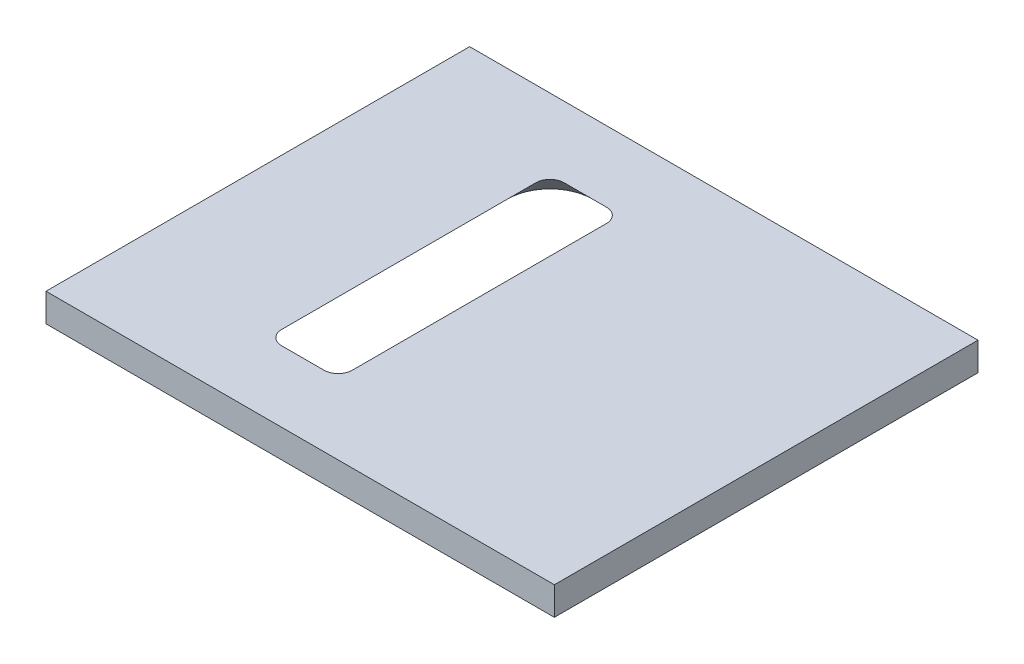
ISO-10303-21;
HEADER;
FILE_DESCRIPTION(('STEP AP214'),'2;1');
FILE_NAME('part.step','',(''),(''),'','','');
FILE_SCHEMA(('AUTOMOTIVE_DESIGN { 1 0 10303 214 1 1 1 1 }'));
ENDSEC;
DATA;
#1=APPLICATION_CONTEXT('core data for automotive mechanical design processes');
#2=APPLICATION_PROTOCOL_DEFINITION('international standard','automotive_design',2000,#1);
#3=PRODUCT_CONTEXT('',#1,'mechanical');
#4=PRODUCT('Part','Part','',(#3));
#5=PRODUCT_RELATED_PRODUCT_CATEGORY('part','',(#4));
#6=PRODUCT_DEFINITION_FORMATION('','',#4);
#7=PRODUCT_DEFINITION_CONTEXT('part definition',#1,'design');
#8=PRODUCT_DEFINITION('design','',#6,#7);
#9=PRODUCT_DEFINITION_SHAPE('','',#8);
#10=(LENGTH_UNIT() NAMED_UNIT(*) SI_UNIT(.MILLI.,.METRE.));
#11=(NAMED_UNIT(*) PLANE_ANGLE_UNIT() SI_UNIT($,.RADIAN.));
#12=(NAMED_UNIT(*) SI_UNIT($,.STERADIAN.) SOLID_ANGLE_UNIT());
#13=UNCERTAINTY_MEASURE_WITH_UNIT(LENGTH_MEASURE(1.E-05),#10,'distance_accuracy_value','');
#14=(GEOMETRIC_REPRESENTATION_CONTEXT(3) GLOBAL_UNCERTAINTY_ASSIGNED_CONTEXT((#13)) GLOBAL_UNIT_ASSIGNED_CONTEXT((#10,
#11,#12)) REPRESENTATION_CONTEXT('',''));
#15=CARTESIAN_POINT('',(0.,0.,0.));
#16=DIRECTION('',(0.,0.,1.));
#17=DIRECTION('',(1.,0.,0.));
#18=AXIS2_PLACEMENT_3D('',#15,#16,#17);
#19=CARTESIAN_POINT('',(22.811028753507,2.,-15.));
#20=DIRECTION('',(-1.,0.,0.));
#21=DIRECTION('',(0.,0.,1.));
#22=AXIS2_PLACEMENT_3D('',#19,#20,#21);
#23=PLANE('',#22);
#24=DIRECTION('',(0.,0.,-1.));
#25=VECTOR('',#24,1.);
#26=CARTESIAN_POINT('',(22.811028753507,0.,-15.));
#27=LINE('',#26,#25);
#28=CARTESIAN_POINT('',(22.811028753507,0.,15.));
#29=VERTEX_POINT('',#28);
#30=CARTESIAN_POINT('',(22.811028753507,0.,-15.));
#31=VERTEX_POINT('',#30);
#32=EDGE_CURVE('E184',#29,#31,#27,.T.);
#33=ORIENTED_EDGE('',*,*,#32,.T.);
#34=DIRECTION('',(0.,-1.,0.));
#35=VECTOR('',#34,1.);
#36=CARTESIAN_POINT('',(22.811028753507,2.,-15.));
#37=LINE('',#36,#35);
#38=CARTESIAN_POINT('',(22.811028753507,2.,-15.));
#39=VERTEX_POINT('',#38);
#40=EDGE_CURVE('E11',#39,#31,#37,.T.);
#41=ORIENTED_EDGE('',*,*,#40,.F.);
#42=DIRECTION('',(0.,0.,-1.));
#43=VECTOR('',#42,1.);
#44=CARTESIAN_POINT('',(22.811028753507,2.,-15.));
#45=LINE('',#44,#43);
#46=CARTESIAN_POINT('',(22.811028753507,2.,15.));
#47=VERTEX_POINT('',#46);
#48=EDGE_CURVE('E195',#47,#39,#45,.T.);
#49=ORIENTED_EDGE('',*,*,#48,.F.);
#50=DIRECTION('',(0.,-1.,0.));
#51=VECTOR('',#50,1.);
#52=CARTESIAN_POINT('',(22.811028753507,2.,15.));
#53=LINE('',#52,#51);
#54=EDGE_CURVE('E205',#47,#29,#53,.T.);
#55=ORIENTED_EDGE('',*,*,#54,.T.);
#56=EDGE_LOOP('',(#33,#41,#49,#55));
#57=FACE_BOUND('',#56,.T.);
#58=ADVANCED_FACE('F37',(#57),#23,.F.);
#59=CARTESIAN_POINT('',(-13.188971246493,2.,-15.));
#60=DIRECTION('',(0.,0.,1.));
#61=DIRECTION('',(1.,0.,0.));
#62=AXIS2_PLACEMENT_3D('',#59,#60,#61);
#63=PLANE('',#62);
#64=DIRECTION('',(-1.,0.,0.));
#65=VECTOR('',#64,1.);
#66=CARTESIAN_POINT('',(-13.188971246493,0.,-15.));
#67=LINE('',#66,#65);
#68=CARTESIAN_POINT('',(-13.188971246493,0.,-15.));
#69=VERTEX_POINT('',#68);
#70=EDGE_CURVE('E208',#31,#69,#67,.T.);
#71=ORIENTED_EDGE('',*,*,#70,.T.);
#72=DIRECTION('',(0.,-1.,0.));
#73=VECTOR('',#72,1.);
#74=CARTESIAN_POINT('',(-13.188971246493,2.,-15.));
#75=LINE('',#74,#73);
#76=CARTESIAN_POINT('',(-13.188971246493,2.,-15.));
#77=VERTEX_POINT('',#76);
#78=EDGE_CURVE('E44',#77,#69,#75,.T.);
#79=ORIENTED_EDGE('',*,*,#78,.F.);
#80=DIRECTION('',(-1.,0.,0.));
#81=VECTOR('',#80,1.);
#82=CARTESIAN_POINT('',(-13.188971246493,2.,-15.));
#83=LINE('',#82,#81);
#84=EDGE_CURVE('E198',#39,#77,#83,.T.);
#85=ORIENTED_EDGE('',*,*,#84,.F.);
#86=ORIENTED_EDGE('',*,*,#40,.T.);
#87=EDGE_LOOP('',(#71,#79,#85,#86));
#88=FACE_BOUND('',#87,.T.);
#89=ADVANCED_FACE('F236',(#88),#63,.F.);
#90=CARTESIAN_POINT('',(-13.188971246493,2.,-15.));
#91=DIRECTION('',(1.,0.,0.));
#92=DIRECTION('',(0.,0.,-1.));
#93=AXIS2_PLACEMENT_3D('',#90,#91,#92);
#94=PLANE('',#93);
#95=DIRECTION('',(0.,0.,1.));
#96=VECTOR('',#95,1.);
#97=CARTESIAN_POINT('',(-13.188971246493,0.,-15.));
#98=LINE('',#97,#96);
#99=CARTESIAN_POINT('',(-13.188971246493,0.,15.));
#100=VERTEX_POINT('',#99);
#101=EDGE_CURVE('E210',#69,#100,#98,.T.);
#102=ORIENTED_EDGE('',*,*,#101,.T.);
#103=DIRECTION('',(0.,-1.,0.));
#104=VECTOR('',#103,1.);
#105=CARTESIAN_POINT('',(-13.188971246493,2.,15.));
#106=LINE('',#105,#104);
#107=CARTESIAN_POINT('',(-13.188971246493,2.,15.));
#108=VERTEX_POINT('',#107);
#109=EDGE_CURVE('E215',#108,#100,#106,.T.);
#110=ORIENTED_EDGE('',*,*,#109,.F.);
#111=DIRECTION('',(0.,0.,1.));
#112=VECTOR('',#111,1.);
#113=CARTESIAN_POINT('',(-13.188971246493,2.,-15.));
#114=LINE('',#113,#112);
#115=EDGE_CURVE('E201',#77,#108,#114,.T.);
#116=ORIENTED_EDGE('',*,*,#115,.F.);
#117=ORIENTED_EDGE('',*,*,#78,.T.);
#118=EDGE_LOOP('',(#102,#110,#116,#117));
#119=FACE_BOUND('',#118,.T.);
#120=ADVANCED_FACE('F222',(#119),#94,.F.);
#121=CARTESIAN_POINT('',(-13.188971246493,2.,15.));
#122=DIRECTION('',(0.,0.,-1.));
#123=DIRECTION('',(-1.,0.,0.));
#124=AXIS2_PLACEMENT_3D('',#121,#122,#123);
#125=PLANE('',#124);
#126=DIRECTION('',(1.,0.,0.));
#127=VECTOR('',#126,1.);
#128=CARTESIAN_POINT('',(-13.188971246493,0.,15.));
#129=LINE('',#128,#127);
#130=EDGE_CURVE('E199',#100,#29,#129,.T.);
#131=ORIENTED_EDGE('',*,*,#130,.T.);
#132=ORIENTED_EDGE('',*,*,#54,.F.);
#133=DIRECTION('',(1.,0.,0.));
#134=VECTOR('',#133,1.);
#135=CARTESIAN_POINT('',(-13.188971246493,2.,15.));
#136=LINE('',#135,#134);
#137=EDGE_CURVE('E203',#108,#47,#136,.T.);
#138=ORIENTED_EDGE('',*,*,#137,.F.);
#139=ORIENTED_EDGE('',*,*,#109,.T.);
#140=EDGE_LOOP('',(#131,#132,#138,#139));
#141=FACE_BOUND('',#140,.T.);
#142=ADVANCED_FACE('F231',(#141),#125,.F.);
#143=CARTESIAN_POINT('',(0.,2.,0.));
#144=DIRECTION('',(0.,1.,0.));
#145=DIRECTION('',(0.,0.,1.));
#146=AXIS2_PLACEMENT_3D('',#143,#144,#145);
#147=PLANE('',#146);
#148=CARTESIAN_POINT('',(1.5,2.,9.));
#149=DIRECTION('',(0.,1.,0.));
#150=DIRECTION('',(0.,0.,1.));
#151=AXIS2_PLACEMENT_3D('',#148,#149,#150);
#152=CIRCLE('',#151,1.);
#153=CARTESIAN_POINT('',(1.5,2.,10.));
#154=VERTEX_POINT('',#153);
#155=CARTESIAN_POINT('',(2.5,2.,9.));
#156=VERTEX_POINT('',#155);
#157=EDGE_CURVE('E51',#154,#156,#152,.T.);
#158=ORIENTED_EDGE('',*,*,#157,.F.);
#159=DIRECTION('',(1.,0.,0.));
#160=VECTOR('',#159,1.);
#161=CARTESIAN_POINT('',(1.5,2.,10.));
#162=LINE('',#161,#160);
#163=CARTESIAN_POINT('',(-1.5,2.,10.));
#164=VERTEX_POINT('',#163);
#165=EDGE_CURVE('E158',#164,#154,#162,.T.);
#166=ORIENTED_EDGE('',*,*,#165,.F.);
#167=CARTESIAN_POINT('',(-1.5,2.,9.));
#168=DIRECTION('',(0.,1.,0.));
#169=DIRECTION('',(0.,0.,-1.));
#170=AXIS2_PLACEMENT_3D('',#167,#168,#169);
#171=CIRCLE('',#170,1.);
#172=CARTESIAN_POINT('',(-2.5,2.,9.));
#173=VERTEX_POINT('',#172);
#174=EDGE_CURVE('E155',#173,#164,#171,.T.);
#175=ORIENTED_EDGE('',*,*,#174,.F.);
#176=DIRECTION('',(0.,0.,1.));
#177=VECTOR('',#176,1.);
#178=CARTESIAN_POINT('',(-2.5,2.,9.));
#179=LINE('',#178,#177);
#180=CARTESIAN_POINT('',(-2.5,2.,-9.));
#181=VERTEX_POINT('',#180);
#182=EDGE_CURVE('E152',#181,#173,#179,.T.);
#183=ORIENTED_EDGE('',*,*,#182,.F.);
#184=CARTESIAN_POINT('',(-1.5,2.,-9.));
#185=DIRECTION('',(0.,1.,0.));
#186=DIRECTION('',(0.,0.,1.));
#187=AXIS2_PLACEMENT_3D('',#184,#185,#186);
#188=CIRCLE('',#187,1.);
#189=CARTESIAN_POINT('',(-1.5,2.,-10.));
#190=VERTEX_POINT('',#189);
#191=EDGE_CURVE('E146',#190,#181,#188,.T.);
#192=ORIENTED_EDGE('',*,*,#191,.F.);
#193=DIRECTION('',(-1.,0.,0.));
#194=VECTOR('',#193,1.);
#195=CARTESIAN_POINT('',(1.5,2.,-10.));
#196=LINE('',#195,#194);
#197=CARTESIAN_POINT('',(1.5,2.,-10.));
#198=VERTEX_POINT('',#197);
#199=EDGE_CURVE('E144',#198,#190,#196,.T.);
#200=ORIENTED_EDGE('',*,*,#199,.F.);
#201=CARTESIAN_POINT('',(1.5,2.,-9.));
#202=DIRECTION('',(0.,1.,0.));
#203=DIRECTION('',(0.,0.,1.));
#204=AXIS2_PLACEMENT_3D('',#201,#202,#203);
#205=CIRCLE('',#204,1.);
#206=CARTESIAN_POINT('',(2.5,2.,-9.));
#207=VERTEX_POINT('',#206);
#208=EDGE_CURVE('E127',#207,#198,#205,.T.);
#209=ORIENTED_EDGE('',*,*,#208,.F.);
#210=DIRECTION('',(0.,0.,-1.));
#211=VECTOR('',#210,1.);
#212=CARTESIAN_POINT('',(2.5,2.,9.));
#213=LINE('',#212,#211);
#214=EDGE_CURVE('E136',#156,#207,#213,.T.);
#215=ORIENTED_EDGE('',*,*,#214,.F.);
#216=EDGE_LOOP('',(#158,#166,#175,#183,#192,#200,#209,#215));
#217=FACE_BOUND('',#216,.T.);
#218=ORIENTED_EDGE('',*,*,#48,.T.);
#219=ORIENTED_EDGE('',*,*,#84,.T.);
#220=ORIENTED_EDGE('',*,*,#115,.T.);
#221=ORIENTED_EDGE('',*,*,#137,.T.);
#222=EDGE_LOOP('',(#218,#219,#220,#221));
#223=FACE_BOUND('',#222,.T.);
#224=ADVANCED_FACE('F140',(#217,#223),#147,.T.);
#225=CARTESIAN_POINT('',(0.,0.,0.));
#226=DIRECTION('',(0.,1.,0.));
#227=DIRECTION('',(0.,0.,1.));
#228=AXIS2_PLACEMENT_3D('',#225,#226,#227);
#229=PLANE('',#228);
#230=DIRECTION('',(1.,0.,0.));
#231=VECTOR('',#230,1.);
#232=CARTESIAN_POINT('',(1.5,0.,12.));
#233=LINE('',#232,#231);
#234=CARTESIAN_POINT('',(-1.5,0.,12.));
#235=VERTEX_POINT('',#234);
#236=CARTESIAN_POINT('',(1.5,0.,12.));
#237=VERTEX_POINT('',#236);
#238=EDGE_CURVE('E165',#235,#237,#233,.T.);
#239=ORIENTED_EDGE('',*,*,#238,.T.);
#240=CARTESIAN_POINT('',(1.5,0.,9.));
#241=DIRECTION('',(0.,1.,0.));
#242=DIRECTION('',(0.,0.,1.));
#243=AXIS2_PLACEMENT_3D('',#240,#241,#242);
#244=CIRCLE('',#243,3.00000000000001);
#245=CARTESIAN_POINT('',(4.50000000000001,0.,9.));
#246=VERTEX_POINT('',#245);
#247=EDGE_CURVE('E161',#237,#246,#244,.T.);
#248=ORIENTED_EDGE('',*,*,#247,.T.);
#249=DIRECTION('',(0.,0.,-1.));
#250=VECTOR('',#249,1.);
#251=CARTESIAN_POINT('',(4.50000000000001,0.,9.));
#252=LINE('',#251,#250);
#253=CARTESIAN_POINT('',(4.50000000000001,0.,-9.));
#254=VERTEX_POINT('',#253);
#255=EDGE_CURVE('E164',#246,#254,#252,.T.);
#256=ORIENTED_EDGE('',*,*,#255,.T.);
#257=CARTESIAN_POINT('',(1.5,0.,-9.));
#258=DIRECTION('',(0.,1.,0.));
#259=DIRECTION('',(0.,0.,1.));
#260=AXIS2_PLACEMENT_3D('',#257,#258,#259);
#261=CIRCLE('',#260,3.00000000000001);
#262=CARTESIAN_POINT('',(1.5,0.,-12.));
#263=VERTEX_POINT('',#262);
#264=EDGE_CURVE('E59',#254,#263,#261,.T.);
#265=ORIENTED_EDGE('',*,*,#264,.T.);
#266=DIRECTION('',(-1.,0.,0.));
#267=VECTOR('',#266,1.);
#268=CARTESIAN_POINT('',(1.5,0.,-12.));
#269=LINE('',#268,#267);
#270=CARTESIAN_POINT('',(-1.5,0.,-12.));
#271=VERTEX_POINT('',#270);
#272=EDGE_CURVE('E177',#263,#271,#269,.T.);
#273=ORIENTED_EDGE('',*,*,#272,.T.);
#274=CARTESIAN_POINT('',(-1.5,0.,-9.));
#275=DIRECTION('',(0.,1.,0.));
#276=DIRECTION('',(0.,0.,1.));
#277=AXIS2_PLACEMENT_3D('',#274,#275,#276);
#278=CIRCLE('',#277,3.00000000000001);
#279=CARTESIAN_POINT('',(-4.50000000000001,0.,-9.));
#280=VERTEX_POINT('',#279);
#281=EDGE_CURVE('E174',#271,#280,#278,.T.);
#282=ORIENTED_EDGE('',*,*,#281,.T.);
#283=DIRECTION('',(0.,0.,1.));
#284=VECTOR('',#283,1.);
#285=CARTESIAN_POINT('',(-4.50000000000001,0.,9.));
#286=LINE('',#285,#284);
#287=CARTESIAN_POINT('',(-4.50000000000001,0.,9.));
#288=VERTEX_POINT('',#287);
#289=EDGE_CURVE('E171',#280,#288,#286,.T.);
#290=ORIENTED_EDGE('',*,*,#289,.T.);
#291=CARTESIAN_POINT('',(-1.5,0.,9.));
#292=DIRECTION('',(0.,1.,0.));
#293=DIRECTION('',(0.,0.,1.));
#294=AXIS2_PLACEMENT_3D('',#291,#292,#293);
#295=CIRCLE('',#294,3.00000000000001);
#296=EDGE_CURVE('E168',#288,#235,#295,.T.);
#297=ORIENTED_EDGE('',*,*,#296,.T.);
#298=EDGE_LOOP('',(#239,#248,#256,#265,#273,#282,#290,#297));
#299=FACE_BOUND('',#298,.T.);
#300=ORIENTED_EDGE('',*,*,#32,.F.);
#301=ORIENTED_EDGE('',*,*,#130,.F.);
#302=ORIENTED_EDGE('',*,*,#101,.F.);
#303=ORIENTED_EDGE('',*,*,#70,.F.);
#304=EDGE_LOOP('',(#300,#301,#302,#303));
#305=FACE_BOUND('',#304,.T.);
#306=ADVANCED_FACE('F228',(#299,#305),#229,.F.);
#307=CARTESIAN_POINT('',(1.5,2.,9.));
#308=DIRECTION('',(0.,-1.,0.));
#309=DIRECTION('',(0.,0.,1.));
#310=AXIS2_PLACEMENT_3D('',#307,#308,#309);
#311=CONICAL_SURFACE('',#310,1.,0.78539816339745);
#312=ORIENTED_EDGE('',*,*,#157,.T.);
#313=DIRECTION('',(0.707106781186549,-0.707106781186546,0.));
#314=VECTOR('',#313,1.);
#315=CARTESIAN_POINT('',(2.5,2.,9.));
#316=LINE('',#315,#314);
#317=EDGE_CURVE('E133',#246,#156,#316,.F.);
#318=ORIENTED_EDGE('',*,*,#317,.F.);
#319=ORIENTED_EDGE('',*,*,#247,.F.);
#320=DIRECTION('',(0.,-0.707106781186546,0.707106781186549));
#321=VECTOR('',#320,1.);
#322=CARTESIAN_POINT('',(1.5,2.,10.));
#323=LINE('',#322,#321);
#324=EDGE_CURVE('E182',#237,#154,#323,.F.);
#325=ORIENTED_EDGE('',*,*,#324,.T.);
#326=EDGE_LOOP('',(#312,#318,#319,#325));
#327=FACE_BOUND('',#326,.T.);
#328=ADVANCED_FACE('F248',(#327),#311,.F.);
#329=CARTESIAN_POINT('',(1.5,2.,10.));
#330=DIRECTION('',(0.,0.707106781186549,0.707106781186546));
#331=DIRECTION('',(0.,-0.707106781186546,0.707106781186549));
#332=AXIS2_PLACEMENT_3D('',#329,#330,#331);
#333=PLANE('',#332);
#334=ORIENTED_EDGE('',*,*,#165,.T.);
#335=ORIENTED_EDGE('',*,*,#324,.F.);
#336=ORIENTED_EDGE('',*,*,#238,.F.);
#337=DIRECTION('',(0.,-0.707106781186546,0.707106781186549));
#338=VECTOR('',#337,1.);
#339=CARTESIAN_POINT('',(-1.5,2.,10.));
#340=LINE('',#339,#338);
#341=EDGE_CURVE('E185',#235,#164,#340,.F.);
#342=ORIENTED_EDGE('',*,*,#341,.T.);
#343=EDGE_LOOP('',(#334,#335,#336,#342));
#344=FACE_BOUND('',#343,.T.);
#345=ADVANCED_FACE('F252',(#344),#333,.F.);
#346=CARTESIAN_POINT('',(-1.5,2.,9.));
#347=DIRECTION('',(0.,-1.,0.));
#348=DIRECTION('',(0.,0.,-1.));
#349=AXIS2_PLACEMENT_3D('',#346,#347,#348);
#350=CONICAL_SURFACE('',#349,1.,0.78539816339745);
#351=ORIENTED_EDGE('',*,*,#174,.T.);
#352=ORIENTED_EDGE('',*,*,#341,.F.);
#353=ORIENTED_EDGE('',*,*,#296,.F.);
#354=DIRECTION('',(-0.707106781186549,-0.707106781186546,0.));
#355=VECTOR('',#354,1.);
#356=CARTESIAN_POINT('',(-2.5,2.,9.));
#357=LINE('',#356,#355);
#358=EDGE_CURVE('E192',#288,#173,#357,.F.);
#359=ORIENTED_EDGE('',*,*,#358,.T.);
#360=EDGE_LOOP('',(#351,#352,#353,#359));
#361=FACE_BOUND('',#360,.T.);
#362=ADVANCED_FACE('F255',(#361),#350,.F.);
#363=CARTESIAN_POINT('',(-2.5,2.,9.));
#364=DIRECTION('',(-0.707106781186546,0.707106781186549,0.));
#365=DIRECTION('',(-0.707106781186549,-0.707106781186546,0.));
#366=AXIS2_PLACEMENT_3D('',#363,#364,#365);
#367=PLANE('',#366);
#368=ORIENTED_EDGE('',*,*,#182,.T.);
#369=ORIENTED_EDGE('',*,*,#358,.F.);
#370=ORIENTED_EDGE('',*,*,#289,.F.);
#371=DIRECTION('',(-0.707106781186549,-0.707106781186546,0.));
#372=VECTOR('',#371,1.);
#373=CARTESIAN_POINT('',(-2.5,2.,-9.));
#374=LINE('',#373,#372);
#375=EDGE_CURVE('E190',#280,#181,#374,.F.);
#376=ORIENTED_EDGE('',*,*,#375,.T.);
#377=EDGE_LOOP('',(#368,#369,#370,#376));
#378=FACE_BOUND('',#377,.T.);
#379=ADVANCED_FACE('F259',(#378),#367,.F.);
#380=CARTESIAN_POINT('',(-1.5,2.,-9.));
#381=DIRECTION('',(0.,-1.,0.));
#382=DIRECTION('',(0.,0.,1.));
#383=AXIS2_PLACEMENT_3D('',#380,#381,#382);
#384=CONICAL_SURFACE('',#383,1.,0.78539816339745);
#385=ORIENTED_EDGE('',*,*,#191,.T.);
#386=ORIENTED_EDGE('',*,*,#375,.F.);
#387=ORIENTED_EDGE('',*,*,#281,.F.);
#388=DIRECTION('',(0.,-0.707106781186546,-0.707106781186549));
#389=VECTOR('',#388,1.);
#390=CARTESIAN_POINT('',(-1.5,2.,-10.));
#391=LINE('',#390,#389);
#392=EDGE_CURVE('E188',#271,#190,#391,.F.);
#393=ORIENTED_EDGE('',*,*,#392,.T.);
#394=EDGE_LOOP('',(#385,#386,#387,#393));
#395=FACE_BOUND('',#394,.T.);
#396=ADVANCED_FACE('F263',(#395),#384,.F.);
#397=CARTESIAN_POINT('',(1.5,2.,-10.));
#398=DIRECTION('',(0.,0.707106781186549,-0.707106781186546));
#399=DIRECTION('',(0.,0.707106781186546,0.707106781186549));
#400=AXIS2_PLACEMENT_3D('',#397,#398,#399);
#401=PLANE('',#400);
#402=ORIENTED_EDGE('',*,*,#199,.T.);
#403=ORIENTED_EDGE('',*,*,#392,.F.);
#404=ORIENTED_EDGE('',*,*,#272,.F.);
#405=DIRECTION('',(0.,-0.707106781186546,-0.707106781186549));
#406=VECTOR('',#405,1.);
#407=CARTESIAN_POINT('',(1.5,2.,-10.));
#408=LINE('',#407,#406);
#409=EDGE_CURVE('E132',#263,#198,#408,.F.);
#410=ORIENTED_EDGE('',*,*,#409,.T.);
#411=EDGE_LOOP('',(#402,#403,#404,#410));
#412=FACE_BOUND('',#411,.T.);
#413=ADVANCED_FACE('F267',(#412),#401,.F.);
#414=CARTESIAN_POINT('',(1.5,2.,-9.));
#415=DIRECTION('',(0.,-1.,0.));
#416=DIRECTION('',(0.,0.,1.));
#417=AXIS2_PLACEMENT_3D('',#414,#415,#416);
#418=CONICAL_SURFACE('',#417,1.,0.78539816339745);
#419=ORIENTED_EDGE('',*,*,#208,.T.);
#420=ORIENTED_EDGE('',*,*,#409,.F.);
#421=ORIENTED_EDGE('',*,*,#264,.F.);
#422=DIRECTION('',(0.707106781186549,-0.707106781186546,0.));
#423=VECTOR('',#422,1.);
#424=CARTESIAN_POINT('',(2.5,2.,-9.));
#425=LINE('',#424,#423);
#426=EDGE_CURVE('E123',#254,#207,#425,.F.);
#427=ORIENTED_EDGE('',*,*,#426,.T.);
#428=EDGE_LOOP('',(#419,#420,#421,#427));
#429=FACE_BOUND('',#428,.T.);
#430=ADVANCED_FACE('F125',(#429),#418,.F.);
#431=CARTESIAN_POINT('',(2.5,2.,9.));
#432=DIRECTION('',(0.707106781186546,0.707106781186549,0.));
#433=DIRECTION('',(-0.707106781186549,0.707106781186546,0.));
#434=AXIS2_PLACEMENT_3D('',#431,#432,#433);
#435=PLANE('',#434);
#436=ORIENTED_EDGE('',*,*,#214,.T.);
#437=ORIENTED_EDGE('',*,*,#426,.F.);
#438=ORIENTED_EDGE('',*,*,#255,.F.);
#439=ORIENTED_EDGE('',*,*,#317,.T.);
#440=EDGE_LOOP('',(#436,#437,#438,#439));
#441=FACE_BOUND('',#440,.T.);
#442=ADVANCED_FACE('F137',(#441),#435,.F.);
#443=CLOSED_SHELL('',(#58,#89,#120,#142,#224,#306,#328,#345,#362,#379,#396,#413,#430,#442));
#444=MANIFOLD_SOLID_BREP('B2',#443);
#445=ADVANCED_BREP_SHAPE_REPRESENTATION('',(#18,#444),#14);
#446=SHAPE_DEFINITION_REPRESENTATION(#9,#445);
ENDSEC;
END-ISO-10303-21;
